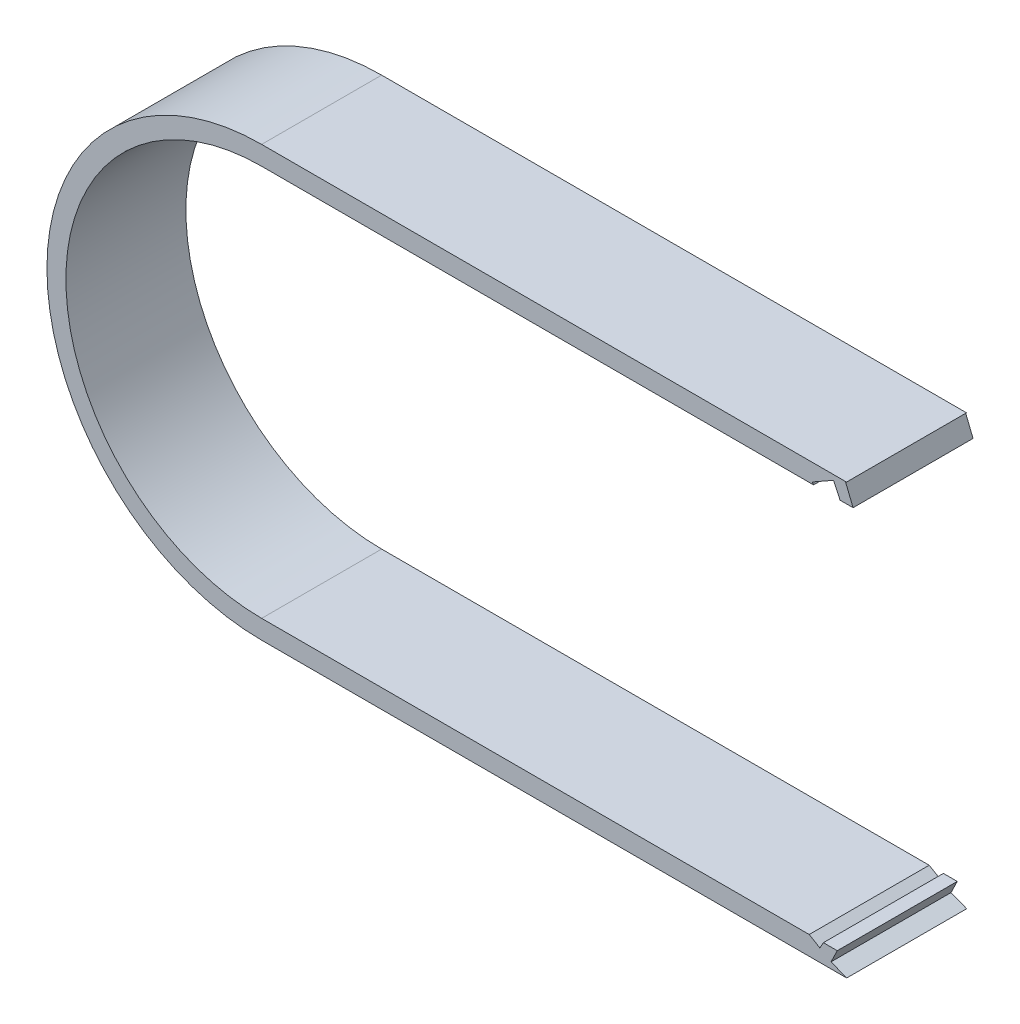
ISO-10303-21;
HEADER;
FILE_DESCRIPTION(('STEP AP214'),'2;1');
FILE_NAME('part.step','',(''),(''),'','','');
FILE_SCHEMA(('AUTOMOTIVE_DESIGN { 1 0 10303 214 1 1 1 1 }'));
ENDSEC;
DATA;
#1=APPLICATION_CONTEXT('core data for automotive mechanical design processes');
#2=APPLICATION_PROTOCOL_DEFINITION('international standard','automotive_design',2000,#1);
#3=PRODUCT_CONTEXT('',#1,'mechanical');
#4=PRODUCT('Part','Part','',(#3));
#5=PRODUCT_RELATED_PRODUCT_CATEGORY('part','',(#4));
#6=PRODUCT_DEFINITION_FORMATION('','',#4);
#7=PRODUCT_DEFINITION_CONTEXT('part definition',#1,'design');
#8=PRODUCT_DEFINITION('design','',#6,#7);
#9=PRODUCT_DEFINITION_SHAPE('','',#8);
#10=(LENGTH_UNIT() NAMED_UNIT(*) SI_UNIT(.MILLI.,.METRE.));
#11=(NAMED_UNIT(*) PLANE_ANGLE_UNIT() SI_UNIT($,.RADIAN.));
#12=(NAMED_UNIT(*) SI_UNIT($,.STERADIAN.) SOLID_ANGLE_UNIT());
#13=UNCERTAINTY_MEASURE_WITH_UNIT(LENGTH_MEASURE(1.E-05),#10,'distance_accuracy_value','');
#14=(GEOMETRIC_REPRESENTATION_CONTEXT(3) GLOBAL_UNCERTAINTY_ASSIGNED_CONTEXT((#13)) GLOBAL_UNIT_ASSIGNED_CONTEXT((#10,
#11,#12)) REPRESENTATION_CONTEXT('',''));
#15=CARTESIAN_POINT('',(0.,0.,0.));
#16=DIRECTION('',(0.,0.,1.));
#17=DIRECTION('',(1.,0.,0.));
#18=AXIS2_PLACEMENT_3D('',#15,#16,#17);
#19=CARTESIAN_POINT('',(-106.18,0.,-9.5));
#20=DIRECTION('',(0.,0.,1.));
#21=DIRECTION('',(1.,0.,0.));
#22=AXIS2_PLACEMENT_3D('',#19,#20,#21);
#23=CYLINDRICAL_SURFACE('',#22,34.);
#24=DIRECTION('',(0.,0.,1.));
#25=VECTOR('',#24,1.);
#26=CARTESIAN_POINT('',(-106.18,-34.,-9.5));
#27=LINE('',#26,#25);
#28=CARTESIAN_POINT('',(-106.18,-34.,-9.5));
#29=VERTEX_POINT('',#28);
#30=CARTESIAN_POINT('',(-106.18,-34.,9.5));
#31=VERTEX_POINT('',#30);
#32=EDGE_CURVE('E311',#29,#31,#27,.T.);
#33=ORIENTED_EDGE('',*,*,#32,.T.);
#34=CARTESIAN_POINT('',(-106.18,0.,9.5));
#35=DIRECTION('',(0.,0.,-1.));
#36=DIRECTION('',(-1.,0.,0.));
#37=AXIS2_PLACEMENT_3D('',#34,#35,#36);
#38=CIRCLE('',#37,34.);
#39=CARTESIAN_POINT('',(-106.18,34.,9.5));
#40=VERTEX_POINT('',#39);
#41=EDGE_CURVE('E284',#40,#31,#38,.F.);
#42=ORIENTED_EDGE('',*,*,#41,.F.);
#43=DIRECTION('',(0.,0.,1.));
#44=VECTOR('',#43,1.);
#45=CARTESIAN_POINT('',(-106.18,34.,-9.5));
#46=LINE('',#45,#44);
#47=CARTESIAN_POINT('',(-106.18,34.,-9.5));
#48=VERTEX_POINT('',#47);
#49=EDGE_CURVE('E310',#48,#40,#46,.T.);
#50=ORIENTED_EDGE('',*,*,#49,.F.);
#51=CARTESIAN_POINT('',(-106.18,0.,-9.5));
#52=DIRECTION('',(0.,0.,-1.));
#53=DIRECTION('',(-1.,0.,0.));
#54=AXIS2_PLACEMENT_3D('',#51,#52,#53);
#55=CIRCLE('',#54,34.);
#56=EDGE_CURVE('E304',#48,#29,#55,.F.);
#57=ORIENTED_EDGE('',*,*,#56,.T.);
#58=EDGE_LOOP('',(#33,#42,#50,#57));
#59=FACE_BOUND('',#58,.T.);
#60=ADVANCED_FACE('F81',(#59),#23,.T.);
#61=CARTESIAN_POINT('',(0.,34.0000000000001,-9.5));
#62=DIRECTION('',(0.,1.,0.));
#63=DIRECTION('',(-1.,0.,0.));
#64=AXIS2_PLACEMENT_3D('',#61,#62,#63);
#65=PLANE('',#64);
#66=DIRECTION('',(0.,0.,1.));
#67=VECTOR('',#66,1.);
#68=CARTESIAN_POINT('',(-13.5604924537327,34.0000000000001,-9.50000000000006));
#69=LINE('',#68,#67);
#70=CARTESIAN_POINT('',(-13.5604924537327,34.0000000000001,-9.5));
#71=VERTEX_POINT('',#70);
#72=CARTESIAN_POINT('',(-13.5604924537328,34.0000000000001,9.5));
#73=VERTEX_POINT('',#72);
#74=EDGE_CURVE('E265',#71,#73,#69,.T.);
#75=ORIENTED_EDGE('',*,*,#74,.F.);
#76=DIRECTION('',(-1.,0.,0.));
#77=VECTOR('',#76,1.);
#78=CARTESIAN_POINT('',(0.,34.0000000000001,-9.5));
#79=LINE('',#78,#77);
#80=EDGE_CURVE('E300',#71,#48,#79,.T.);
#81=ORIENTED_EDGE('',*,*,#80,.T.);
#82=ORIENTED_EDGE('',*,*,#49,.T.);
#83=DIRECTION('',(-1.,0.,0.));
#84=VECTOR('',#83,1.);
#85=CARTESIAN_POINT('',(0.,34.0000000000001,9.5));
#86=LINE('',#85,#84);
#87=EDGE_CURVE('E282',#73,#40,#86,.T.);
#88=ORIENTED_EDGE('',*,*,#87,.F.);
#89=EDGE_LOOP('',(#75,#81,#82,#88));
#90=FACE_BOUND('',#89,.T.);
#91=ADVANCED_FACE('F83',(#90),#65,.T.);
#92=CARTESIAN_POINT('',(-10.1045238986109,35.2816103582913,-20.5000000000001));
#93=DIRECTION('',(-0.347701294528303,0.937605359297472,0.));
#94=DIRECTION('',(-0.937605359297472,-0.347701294528303,0.));
#95=AXIS2_PLACEMENT_3D('',#92,#93,#94);
#96=PLANE('',#95);
#97=ORIENTED_EDGE('',*,*,#74,.T.);
#98=DIRECTION('',(0.937605359297472,0.347701294528303,0.));
#99=VECTOR('',#98,1.);
#100=CARTESIAN_POINT('',(-12.7236361793878,34.31033953362,9.5));
#101=LINE('',#100,#99);
#102=CARTESIAN_POINT('',(-13.7119885708228,33.9438192246815,9.49999999999995));
#103=VERTEX_POINT('',#102);
#104=EDGE_CURVE('E313',#103,#73,#101,.T.);
#105=ORIENTED_EDGE('',*,*,#104,.F.);
#106=DIRECTION('',(0.,0.,1.));
#107=VECTOR('',#106,1.);
#108=CARTESIAN_POINT('',(-13.7119885708228,33.9438192246815,-20.5000000000001));
#109=LINE('',#108,#107);
#110=CARTESIAN_POINT('',(-13.7119885708228,33.9438192246815,-9.5));
#111=VERTEX_POINT('',#110);
#112=EDGE_CURVE('E261',#111,#103,#109,.T.);
#113=ORIENTED_EDGE('',*,*,#112,.F.);
#114=DIRECTION('',(0.937605359297472,0.347701294528303,0.));
#115=VECTOR('',#114,1.);
#116=CARTESIAN_POINT('',(-12.7236361793878,34.31033953362,-9.5));
#117=LINE('',#116,#115);
#118=EDGE_CURVE('E263',#111,#71,#117,.T.);
#119=ORIENTED_EDGE('',*,*,#118,.T.);
#120=EDGE_LOOP('',(#97,#105,#113,#119));
#121=FACE_BOUND('',#120,.T.);
#122=ADVANCED_FACE('F367',(#121),#96,.F.);
#123=CARTESIAN_POINT('',(-13.7119885708228,33.9438192246815,-20.5000000000001));
#124=DIRECTION('',(-0.927204769486887,-0.374554823010956,0.));
#125=DIRECTION('',(0.374554823010956,-0.927204769486887,0.));
#126=AXIS2_PLACEMENT_3D('',#123,#124,#125);
#127=PLANE('',#126);
#128=DIRECTION('',(-0.374554823010956,0.927204769486887,0.));
#129=VECTOR('',#128,1.);
#130=CARTESIAN_POINT('',(-1.48481955402565E-13,0.,-9.5));
#131=LINE('',#130,#129);
#132=CARTESIAN_POINT('',(-12.5227995966472,31.0000000000001,-9.5));
#133=VERTEX_POINT('',#132);
#134=EDGE_CURVE('E270',#133,#111,#131,.T.);
#135=ORIENTED_EDGE('',*,*,#134,.T.);
#136=ORIENTED_EDGE('',*,*,#112,.T.);
#137=DIRECTION('',(0.374554823010956,-0.927204769486887,0.));
#138=VECTOR('',#137,1.);
#139=CARTESIAN_POINT('',(-13.7119885708228,33.9438192246815,9.49999999999995));
#140=LINE('',#139,#138);
#141=CARTESIAN_POINT('',(-12.5227995966472,31.0000000000001,9.49999999999995));
#142=VERTEX_POINT('',#141);
#143=EDGE_CURVE('E259',#103,#142,#140,.T.);
#144=ORIENTED_EDGE('',*,*,#143,.T.);
#145=DIRECTION('',(0.,0.,1.));
#146=VECTOR('',#145,1.);
#147=CARTESIAN_POINT('',(-12.5227995966472,31.0000000000001,-9.49999999999999));
#148=LINE('',#147,#146);
#149=EDGE_CURVE('E267',#133,#142,#148,.T.);
#150=ORIENTED_EDGE('',*,*,#149,.F.);
#151=EDGE_LOOP('',(#135,#136,#144,#150));
#152=FACE_BOUND('',#151,.T.);
#153=ADVANCED_FACE('F360',(#152),#127,.F.);
#154=CARTESIAN_POINT('',(0.,31.0000000000001,-9.5));
#155=DIRECTION('',(0.,1.,0.));
#156=DIRECTION('',(-1.,0.,0.));
#157=AXIS2_PLACEMENT_3D('',#154,#155,#156);
#158=PLANE('',#157);
#159=DIRECTION('',(-1.,0.,0.));
#160=VECTOR('',#159,1.);
#161=CARTESIAN_POINT('',(0.,31.0000000000001,9.5));
#162=LINE('',#161,#160);
#163=CARTESIAN_POINT('',(-14.5822358882404,31.0000000000001,9.5));
#164=VERTEX_POINT('',#163);
#165=EDGE_CURVE('E274',#142,#164,#162,.T.);
#166=ORIENTED_EDGE('',*,*,#165,.T.);
#167=DIRECTION('',(0.,0.,-1.));
#168=VECTOR('',#167,1.);
#169=CARTESIAN_POINT('',(-14.5822358882404,31.0000000000001,-9.49999999999998));
#170=LINE('',#169,#168);
#171=CARTESIAN_POINT('',(-14.5822358882404,31.0000000000001,-9.5));
#172=VERTEX_POINT('',#171);
#173=EDGE_CURVE('E246',#164,#172,#170,.T.);
#174=ORIENTED_EDGE('',*,*,#173,.T.);
#175=DIRECTION('',(-1.,0.,0.));
#176=VECTOR('',#175,1.);
#177=CARTESIAN_POINT('',(0.,31.0000000000001,-9.5));
#178=LINE('',#177,#176);
#179=EDGE_CURVE('E289',#133,#172,#178,.T.);
#180=ORIENTED_EDGE('',*,*,#179,.F.);
#181=ORIENTED_EDGE('',*,*,#149,.T.);
#182=EDGE_LOOP('',(#166,#174,#180,#181));
#183=FACE_BOUND('',#182,.T.);
#184=ADVANCED_FACE('F356',(#183),#158,.F.);
#185=CARTESIAN_POINT('',(-13.7911785586929,29.3183115810281,-20.5000000000001));
#186=DIRECTION('',(0.904886159908276,0.425653659218917,0.));
#187=DIRECTION('',(-0.425653659218917,0.904886159908276,0.));
#188=AXIS2_PLACEMENT_3D('',#185,#186,#187);
#189=PLANE('',#188);
#190=DIRECTION('',(0.425653659218917,-0.904886159908276,0.));
#191=VECTOR('',#190,1.);
#192=CARTESIAN_POINT('',(0.,0.,-9.5));
#193=LINE('',#192,#191);
#194=CARTESIAN_POINT('',(-15.621509199832,33.2093643873449,-9.5));
#195=VERTEX_POINT('',#194);
#196=EDGE_CURVE('E250',#195,#172,#193,.T.);
#197=ORIENTED_EDGE('',*,*,#196,.T.);
#198=ORIENTED_EDGE('',*,*,#173,.F.);
#199=DIRECTION('',(0.425653659218917,-0.904886159908276,0.));
#200=VECTOR('',#199,1.);
#201=CARTESIAN_POINT('',(0.,0.,9.5));
#202=LINE('',#201,#200);
#203=CARTESIAN_POINT('',(-15.621509199832,33.2093643873449,9.4999999999999));
#204=VERTEX_POINT('',#203);
#205=EDGE_CURVE('E318',#204,#164,#202,.T.);
#206=ORIENTED_EDGE('',*,*,#205,.F.);
#207=DIRECTION('',(0.,0.,1.));
#208=VECTOR('',#207,1.);
#209=CARTESIAN_POINT('',(-15.621509199832,33.2093643873448,-20.5000000000001));
#210=LINE('',#209,#208);
#211=EDGE_CURVE('E243',#195,#204,#210,.T.);
#212=ORIENTED_EDGE('',*,*,#211,.F.);
#213=EDGE_LOOP('',(#197,#198,#206,#212));
#214=FACE_BOUND('',#213,.T.);
#215=ADVANCED_FACE('F351',(#214),#189,.F.);
#216=CARTESIAN_POINT('',(-15.621509199832,33.2093643873448,-20.5000000000001));
#217=DIRECTION('',(-0.493293834195668,0.869862743853613,0.));
#218=DIRECTION('',(-0.869862743853613,-0.493293834195668,0.));
#219=AXIS2_PLACEMENT_3D('',#216,#217,#218);
#220=PLANE('',#219);
#221=DIRECTION('',(0.869862743853613,0.493293834195668,0.));
#222=VECTOR('',#221,1.);
#223=CARTESIAN_POINT('',(-18.0513888634085,31.8313945129603,-9.5));
#224=LINE('',#223,#222);
#225=CARTESIAN_POINT('',(-18.9683321323251,31.3114016013661,-9.5));
#226=VERTEX_POINT('',#225);
#227=EDGE_CURVE('E252',#226,#195,#224,.T.);
#228=ORIENTED_EDGE('',*,*,#227,.T.);
#229=ORIENTED_EDGE('',*,*,#211,.T.);
#230=DIRECTION('',(-0.869862743853613,-0.493293834195668,0.));
#231=VECTOR('',#230,1.);
#232=CARTESIAN_POINT('',(-15.621509199832,33.2093643873449,9.4999999999999));
#233=LINE('',#232,#231);
#234=CARTESIAN_POINT('',(-18.9683321323251,31.3114016013662,9.4999999999999));
#235=VERTEX_POINT('',#234);
#236=EDGE_CURVE('E238',#204,#235,#233,.T.);
#237=ORIENTED_EDGE('',*,*,#236,.T.);
#238=DIRECTION('',(0.,0.,1.));
#239=VECTOR('',#238,1.);
#240=CARTESIAN_POINT('',(-18.9683321323251,31.3114016013661,-20.5000000000001));
#241=LINE('',#240,#239);
#242=EDGE_CURVE('E244',#226,#235,#241,.T.);
#243=ORIENTED_EDGE('',*,*,#242,.F.);
#244=EDGE_LOOP('',(#228,#229,#237,#243));
#245=FACE_BOUND('',#244,.T.);
#246=ADVANCED_FACE('F348',(#245),#220,.F.);
#247=CARTESIAN_POINT('',(-18.9683321323251,31.3114016013661,-20.5000000000001));
#248=DIRECTION('',(-0.855298006153534,-0.518136391956587,0.));
#249=DIRECTION('',(0.518136391956587,-0.855298006153534,0.));
#250=AXIS2_PLACEMENT_3D('',#247,#248,#249);
#251=PLANE('',#250);
#252=DIRECTION('',(-0.518136391956587,0.855298006153534,0.));
#253=VECTOR('',#252,1.);
#254=CARTESIAN_POINT('',(-1.55309446926976E-13,0.,-9.5));
#255=LINE('',#254,#253);
#256=CARTESIAN_POINT('',(-18.7796861855084,31.0000000000001,-9.5));
#257=VERTEX_POINT('',#256);
#258=EDGE_CURVE('E257',#257,#226,#255,.T.);
#259=ORIENTED_EDGE('',*,*,#258,.T.);
#260=ORIENTED_EDGE('',*,*,#242,.T.);
#261=DIRECTION('',(0.518136391956587,-0.855298006153534,0.));
#262=VECTOR('',#261,1.);
#263=CARTESIAN_POINT('',(-18.9683321323251,31.3114016013662,9.4999999999999));
#264=LINE('',#263,#262);
#265=CARTESIAN_POINT('',(-18.7796861855083,31.0000000000001,9.4999999999999));
#266=VERTEX_POINT('',#265);
#267=EDGE_CURVE('E241',#235,#266,#264,.T.);
#268=ORIENTED_EDGE('',*,*,#267,.T.);
#269=DIRECTION('',(0.,0.,1.));
#270=VECTOR('',#269,1.);
#271=CARTESIAN_POINT('',(-18.7796861855084,31.0000000000001,-9.49999999999997));
#272=LINE('',#271,#270);
#273=EDGE_CURVE('E254',#257,#266,#272,.T.);
#274=ORIENTED_EDGE('',*,*,#273,.F.);
#275=EDGE_LOOP('',(#259,#260,#268,#274));
#276=FACE_BOUND('',#275,.T.);
#277=ADVANCED_FACE('F339',(#276),#251,.F.);
#278=CARTESIAN_POINT('',(-106.18,31.,-9.5));
#279=VERTEX_POINT('',#278);
#280=EDGE_CURVE('E287',#257,#279,#178,.T.);
#281=ORIENTED_EDGE('',*,*,#280,.F.);
#282=ORIENTED_EDGE('',*,*,#273,.T.);
#283=CARTESIAN_POINT('',(-106.18,31.,9.5));
#284=VERTEX_POINT('',#283);
#285=EDGE_CURVE('E272',#266,#284,#162,.T.);
#286=ORIENTED_EDGE('',*,*,#285,.T.);
#287=DIRECTION('',(0.,0.,1.));
#288=VECTOR('',#287,1.);
#289=CARTESIAN_POINT('',(-106.18,31.,-9.5));
#290=LINE('',#289,#288);
#291=EDGE_CURVE('E297',#279,#284,#290,.T.);
#292=ORIENTED_EDGE('',*,*,#291,.F.);
#293=EDGE_LOOP('',(#281,#282,#286,#292));
#294=FACE_BOUND('',#293,.T.);
#295=ADVANCED_FACE('F336',(#294),#158,.F.);
#296=CARTESIAN_POINT('',(-106.18,0.,-9.5));
#297=DIRECTION('',(0.,0.,1.));
#298=DIRECTION('',(1.,0.,0.));
#299=AXIS2_PLACEMENT_3D('',#296,#297,#298);
#300=CYLINDRICAL_SURFACE('',#299,31.);
#301=ORIENTED_EDGE('',*,*,#291,.T.);
#302=CARTESIAN_POINT('',(-106.18,0.,9.5));
#303=DIRECTION('',(0.,0.,-1.));
#304=DIRECTION('',(-1.,0.,0.));
#305=AXIS2_PLACEMENT_3D('',#302,#303,#304);
#306=CIRCLE('',#305,31.);
#307=CARTESIAN_POINT('',(-106.18,-31.,9.5));
#308=VERTEX_POINT('',#307);
#309=EDGE_CURVE('E275',#284,#308,#306,.F.);
#310=ORIENTED_EDGE('',*,*,#309,.T.);
#311=DIRECTION('',(0.,0.,1.));
#312=VECTOR('',#311,1.);
#313=CARTESIAN_POINT('',(-106.18,-31.,-9.5));
#314=LINE('',#313,#312);
#315=CARTESIAN_POINT('',(-106.18,-31.,-9.5));
#316=VERTEX_POINT('',#315);
#317=EDGE_CURVE('E298',#316,#308,#314,.T.);
#318=ORIENTED_EDGE('',*,*,#317,.F.);
#319=CARTESIAN_POINT('',(-106.18,0.,-9.5));
#320=DIRECTION('',(0.,0.,-1.));
#321=DIRECTION('',(-1.,0.,0.));
#322=AXIS2_PLACEMENT_3D('',#319,#320,#321);
#323=CIRCLE('',#322,31.);
#324=EDGE_CURVE('E290',#279,#316,#323,.F.);
#325=ORIENTED_EDGE('',*,*,#324,.F.);
#326=EDGE_LOOP('',(#301,#310,#318,#325));
#327=FACE_BOUND('',#326,.T.);
#328=ADVANCED_FACE('F329',(#327),#300,.F.);
#329=CARTESIAN_POINT('',(0.,-30.9999999999999,-9.5));
#330=DIRECTION('',(0.,-1.,0.));
#331=DIRECTION('',(1.,0.,0.));
#332=AXIS2_PLACEMENT_3D('',#329,#330,#331);
#333=PLANE('',#332);
#334=DIRECTION('',(1.,0.,0.));
#335=VECTOR('',#334,1.);
#336=CARTESIAN_POINT('',(0.,-30.9999999999999,9.5));
#337=LINE('',#336,#335);
#338=CARTESIAN_POINT('',(-19.465689183762,-30.9999999999999,9.5));
#339=VERTEX_POINT('',#338);
#340=EDGE_CURVE('E279',#308,#339,#337,.T.);
#341=ORIENTED_EDGE('',*,*,#340,.T.);
#342=DIRECTION('',(0.,0.,-1.));
#343=VECTOR('',#342,1.);
#344=CARTESIAN_POINT('',(-19.465689183762,-30.9999999999999,-9.50000000000006));
#345=LINE('',#344,#343);
#346=CARTESIAN_POINT('',(-19.465689183762,-30.9999999999999,-9.5));
#347=VERTEX_POINT('',#346);
#348=EDGE_CURVE('E103',#339,#347,#345,.T.);
#349=ORIENTED_EDGE('',*,*,#348,.T.);
#350=DIRECTION('',(1.,0.,0.));
#351=VECTOR('',#350,1.);
#352=CARTESIAN_POINT('',(0.,-30.9999999999999,-9.5));
#353=LINE('',#352,#351);
#354=EDGE_CURVE('E294',#316,#347,#353,.T.);
#355=ORIENTED_EDGE('',*,*,#354,.F.);
#356=ORIENTED_EDGE('',*,*,#317,.T.);
#357=EDGE_LOOP('',(#341,#349,#355,#356));
#358=FACE_BOUND('',#357,.T.);
#359=ADVANCED_FACE('F325',(#358),#333,.F.);
#360=CARTESIAN_POINT('',(-21.0875785711729,-30.0367685128825,-20.5000000000001));
#361=DIRECTION('',(-0.510630726639647,-0.859800128524919,0.));
#362=DIRECTION('',(0.859800128524919,-0.510630726639647,0.));
#363=AXIS2_PLACEMENT_3D('',#360,#361,#362);
#364=PLANE('',#363);
#365=DIRECTION('',(-0.859800128524919,0.510630726639647,0.));
#366=VECTOR('',#365,1.);
#367=CARTESIAN_POINT('',(-18.6858078759625,-31.4631673637656,-9.5));
#368=LINE('',#367,#366);
#369=CARTESIAN_POINT('',(-17.7794718522216,-32.0014355112437,-9.5));
#370=VERTEX_POINT('',#369);
#371=EDGE_CURVE('E231',#370,#347,#368,.T.);
#372=ORIENTED_EDGE('',*,*,#371,.T.);
#373=ORIENTED_EDGE('',*,*,#348,.F.);
#374=DIRECTION('',(-0.859800128524919,0.510630726639647,0.));
#375=VECTOR('',#374,1.);
#376=CARTESIAN_POINT('',(-18.6858078759625,-31.4631673637657,9.5));
#377=LINE('',#376,#375);
#378=CARTESIAN_POINT('',(-17.7794718522219,-32.0014355112436,9.49999999999996));
#379=VERTEX_POINT('',#378);
#380=EDGE_CURVE('E89',#379,#339,#377,.T.);
#381=ORIENTED_EDGE('',*,*,#380,.F.);
#382=DIRECTION('',(0.,0.,1.));
#383=VECTOR('',#382,1.);
#384=CARTESIAN_POINT('',(-17.7794718522214,-32.0014355112438,-20.5));
#385=LINE('',#384,#383);
#386=EDGE_CURVE('E228',#370,#379,#385,.T.);
#387=ORIENTED_EDGE('',*,*,#386,.F.);
#388=EDGE_LOOP('',(#372,#373,#381,#387));
#389=FACE_BOUND('',#388,.T.);
#390=ADVANCED_FACE('F385',(#389),#364,.F.);
#391=CARTESIAN_POINT('',(-17.7794718522214,-32.0014355112438,-20.5));
#392=DIRECTION('',(0.874146878995773,-0.485661645533132,0.));
#393=DIRECTION('',(0.485661645533132,0.874146878995773,0.));
#394=AXIS2_PLACEMENT_3D('',#391,#392,#393);
#395=PLANE('',#394);
#396=DIRECTION('',(-0.485661645533132,-0.874146878995773,0.));
#397=VECTOR('',#396,1.);
#398=CARTESIAN_POINT('',(2.82694100573245E-13,0.,-9.5));
#399=LINE('',#398,#397);
#400=CARTESIAN_POINT('',(-17.2230907337022,-30.9999999999999,-9.5));
#401=VERTEX_POINT('',#400);
#402=EDGE_CURVE('E236',#401,#370,#399,.T.);
#403=ORIENTED_EDGE('',*,*,#402,.T.);
#404=ORIENTED_EDGE('',*,*,#386,.T.);
#405=DIRECTION('',(0.485661645533132,0.874146878995773,0.));
#406=VECTOR('',#405,1.);
#407=CARTESIAN_POINT('',(-17.7794718522219,-32.0014355112436,9.49999999999996));
#408=LINE('',#407,#406);
#409=CARTESIAN_POINT('',(-17.2230907337025,-30.9999999999999,9.49999999999996));
#410=VERTEX_POINT('',#409);
#411=EDGE_CURVE('E226',#379,#410,#408,.T.);
#412=ORIENTED_EDGE('',*,*,#411,.T.);
#413=DIRECTION('',(0.,0.,1.));
#414=VECTOR('',#413,1.);
#415=CARTESIAN_POINT('',(-17.2230907337022,-30.9999999999999,-9.50000000000035));
#416=LINE('',#415,#414);
#417=EDGE_CURVE('E233',#401,#410,#416,.T.);
#418=ORIENTED_EDGE('',*,*,#417,.F.);
#419=EDGE_LOOP('',(#403,#404,#412,#418));
#420=FACE_BOUND('',#419,.T.);
#421=ADVANCED_FACE('F383',(#420),#395,.F.);
#422=CARTESIAN_POINT('',(0.,0.,-9.5));
#423=DIRECTION('',(0.,0.,-1.));
#424=DIRECTION('',(-1.,0.,0.));
#425=AXIS2_PLACEMENT_3D('',#422,#423,#424);
#426=PLANE('',#425);
#427=DIRECTION('',(-0.930447469573626,0.366425308028849,0.));
#428=VECTOR('',#427,1.);
#429=CARTESIAN_POINT('',(-13.4088149214518,-34.048406701929,-9.5));
#430=LINE('',#429,#428);
#431=CARTESIAN_POINT('',(-13.5317319043494,-34.,-9.5));
#432=VERTEX_POINT('',#431);
#433=CARTESIAN_POINT('',(-16.0079323113139,-33.0248321087069,-9.5));
#434=VERTEX_POINT('',#433);
#435=EDGE_CURVE('E206',#432,#434,#430,.T.);
#436=ORIENTED_EDGE('',*,*,#435,.F.);
#437=DIRECTION('',(1.,0.,0.));
#438=VECTOR('',#437,1.);
#439=CARTESIAN_POINT('',(0.,-33.9999999999999,-9.5));
#440=LINE('',#439,#438);
#441=EDGE_CURVE('E307',#29,#432,#440,.T.);
#442=ORIENTED_EDGE('',*,*,#441,.F.);
#443=ORIENTED_EDGE('',*,*,#56,.F.);
#444=ORIENTED_EDGE('',*,*,#80,.F.);
#445=ORIENTED_EDGE('',*,*,#118,.F.);
#446=ORIENTED_EDGE('',*,*,#134,.F.);
#447=ORIENTED_EDGE('',*,*,#179,.T.);
#448=ORIENTED_EDGE('',*,*,#196,.F.);
#449=ORIENTED_EDGE('',*,*,#227,.F.);
#450=ORIENTED_EDGE('',*,*,#258,.F.);
#451=ORIENTED_EDGE('',*,*,#280,.T.);
#452=ORIENTED_EDGE('',*,*,#324,.T.);
#453=ORIENTED_EDGE('',*,*,#354,.T.);
#454=ORIENTED_EDGE('',*,*,#371,.F.);
#455=ORIENTED_EDGE('',*,*,#402,.F.);
#456=CARTESIAN_POINT('',(-15.0264473720033,-30.9999999999999,-9.5));
#457=VERTEX_POINT('',#456);
#458=EDGE_CURVE('E293',#401,#457,#353,.T.);
#459=ORIENTED_EDGE('',*,*,#458,.T.);
#460=DIRECTION('',(0.436182885896382,0.899858038832295,0.));
#461=VECTOR('',#460,1.);
#462=CARTESIAN_POINT('',(2.27211835847417E-13,0.,-9.5));
#463=LINE('',#462,#461);
#464=EDGE_CURVE('E208',#434,#457,#463,.T.);
#465=ORIENTED_EDGE('',*,*,#464,.F.);
#466=EDGE_LOOP('',(#436,#442,#443,#444,#445,#446,#447,#448,#449,#450,#451,#452,#453,#454,#455,
#459,#465));
#467=FACE_BOUND('',#466,.T.);
#468=ADVANCED_FACE('F343',(#467),#426,.T.);
#469=CARTESIAN_POINT('',(0.,0.,9.5));
#470=DIRECTION('',(0.,0.,-1.));
#471=DIRECTION('',(-1.,0.,0.));
#472=AXIS2_PLACEMENT_3D('',#469,#470,#471);
#473=PLANE('',#472);
#474=DIRECTION('',(1.,0.,0.));
#475=VECTOR('',#474,1.);
#476=CARTESIAN_POINT('',(0.,-33.9999999999999,9.5));
#477=LINE('',#476,#475);
#478=CARTESIAN_POINT('',(-13.5317319043494,-34.,9.49999999999999));
#479=VERTEX_POINT('',#478);
#480=EDGE_CURVE('E218',#31,#479,#477,.T.);
#481=ORIENTED_EDGE('',*,*,#480,.T.);
#482=DIRECTION('',(0.930447469573626,-0.366425308028849,0.));
#483=VECTOR('',#482,1.);
#484=CARTESIAN_POINT('',(-16.0079323113142,-33.0248321087068,9.49999999999994));
#485=LINE('',#484,#483);
#486=CARTESIAN_POINT('',(-16.0079323113142,-33.0248321087068,9.49999999999994));
#487=VERTEX_POINT('',#486);
#488=EDGE_CURVE('E203',#487,#479,#485,.T.);
#489=ORIENTED_EDGE('',*,*,#488,.F.);
#490=DIRECTION('',(0.436182885896382,0.899858038832295,0.));
#491=VECTOR('',#490,1.);
#492=CARTESIAN_POINT('',(0.,1.31507902301936E-13,9.5));
#493=LINE('',#492,#491);
#494=CARTESIAN_POINT('',(-15.0264473720037,-30.9999999999999,9.5));
#495=VERTEX_POINT('',#494);
#496=EDGE_CURVE('E12',#487,#495,#493,.T.);
#497=ORIENTED_EDGE('',*,*,#496,.T.);
#498=EDGE_CURVE('E278',#410,#495,#337,.T.);
#499=ORIENTED_EDGE('',*,*,#498,.F.);
#500=ORIENTED_EDGE('',*,*,#411,.F.);
#501=ORIENTED_EDGE('',*,*,#380,.T.);
#502=ORIENTED_EDGE('',*,*,#340,.F.);
#503=ORIENTED_EDGE('',*,*,#309,.F.);
#504=ORIENTED_EDGE('',*,*,#285,.F.);
#505=ORIENTED_EDGE('',*,*,#267,.F.);
#506=ORIENTED_EDGE('',*,*,#236,.F.);
#507=ORIENTED_EDGE('',*,*,#205,.T.);
#508=ORIENTED_EDGE('',*,*,#165,.F.);
#509=ORIENTED_EDGE('',*,*,#143,.F.);
#510=ORIENTED_EDGE('',*,*,#104,.T.);
#511=ORIENTED_EDGE('',*,*,#87,.T.);
#512=ORIENTED_EDGE('',*,*,#41,.T.);
#513=EDGE_LOOP('',(#481,#489,#497,#499,#500,#501,#502,#503,#504,#505,#506,#507,#508,#509,#510,
#511,#512));
#514=FACE_BOUND('',#513,.T.);
#515=ADVANCED_FACE('F215',(#514),#473,.F.);
#516=CARTESIAN_POINT('',(0.,-33.9999999999999,-9.5));
#517=DIRECTION('',(0.,-1.,0.));
#518=DIRECTION('',(1.,0.,0.));
#519=AXIS2_PLACEMENT_3D('',#516,#517,#518);
#520=PLANE('',#519);
#521=DIRECTION('',(0.,0.,-1.));
#522=VECTOR('',#521,1.);
#523=CARTESIAN_POINT('',(-13.5317319043496,-33.9999999999999,-9.50000000000001));
#524=LINE('',#523,#522);
#525=EDGE_CURVE('E224',#479,#432,#524,.T.);
#526=ORIENTED_EDGE('',*,*,#525,.F.);
#527=ORIENTED_EDGE('',*,*,#480,.F.);
#528=ORIENTED_EDGE('',*,*,#32,.F.);
#529=ORIENTED_EDGE('',*,*,#441,.T.);
#530=EDGE_LOOP('',(#526,#527,#528,#529));
#531=FACE_BOUND('',#530,.T.);
#532=ADVANCED_FACE('F375',(#531),#520,.T.);
#533=ORIENTED_EDGE('',*,*,#498,.T.);
#534=DIRECTION('',(0.,0.,-1.));
#535=VECTOR('',#534,1.);
#536=CARTESIAN_POINT('',(-15.0264473720033,-30.9999999999999,-9.5000000000003));
#537=LINE('',#536,#535);
#538=EDGE_CURVE('E96',#495,#457,#537,.T.);
#539=ORIENTED_EDGE('',*,*,#538,.T.);
#540=ORIENTED_EDGE('',*,*,#458,.F.);
#541=ORIENTED_EDGE('',*,*,#417,.T.);
#542=EDGE_LOOP('',(#533,#539,#540,#541));
#543=FACE_BOUND('',#542,.T.);
#544=ADVANCED_FACE('F381',(#543),#333,.F.);
#545=CARTESIAN_POINT('',(-14.1323255030424,-29.1554004581665,-20.5000000000001));
#546=DIRECTION('',(-0.899858038832295,0.436182885896382,0.));
#547=DIRECTION('',(-0.436182885896382,-0.899858038832295,0.));
#548=AXIS2_PLACEMENT_3D('',#545,#546,#547);
#549=PLANE('',#548);
#550=ORIENTED_EDGE('',*,*,#496,.F.);
#551=DIRECTION('',(0.,0.,1.));
#552=VECTOR('',#551,1.);
#553=CARTESIAN_POINT('',(-16.0079323113137,-33.024832108707,-20.5000000000001));
#554=LINE('',#553,#552);
#555=EDGE_CURVE('E200',#434,#487,#554,.T.);
#556=ORIENTED_EDGE('',*,*,#555,.F.);
#557=ORIENTED_EDGE('',*,*,#464,.T.);
#558=ORIENTED_EDGE('',*,*,#538,.F.);
#559=EDGE_LOOP('',(#550,#556,#557,#558));
#560=FACE_BOUND('',#559,.T.);
#561=ADVANCED_FACE('F210',(#560),#549,.F.);
#562=CARTESIAN_POINT('',(-16.0079323113137,-33.024832108707,-20.5000000000001));
#563=DIRECTION('',(-0.366425308028849,-0.930447469573626,0.));
#564=DIRECTION('',(0.930447469573626,-0.366425308028849,0.));
#565=AXIS2_PLACEMENT_3D('',#562,#563,#564);
#566=PLANE('',#565);
#567=ORIENTED_EDGE('',*,*,#525,.T.);
#568=ORIENTED_EDGE('',*,*,#435,.T.);
#569=ORIENTED_EDGE('',*,*,#555,.T.);
#570=ORIENTED_EDGE('',*,*,#488,.T.);
#571=EDGE_LOOP('',(#567,#568,#569,#570));
#572=FACE_BOUND('',#571,.T.);
#573=ADVANCED_FACE('F201',(#572),#566,.F.);
#574=CLOSED_SHELL('',(#60,#91,#122,#153,#184,#215,#246,#277,#295,#328,#359,#390,#421,#468,#515,
#532,#544,#561,#573));
#575=MANIFOLD_SOLID_BREP('B2',#574);
#576=ADVANCED_BREP_SHAPE_REPRESENTATION('',(#18,#575),#14);
#577=SHAPE_DEFINITION_REPRESENTATION(#9,#576);
ENDSEC;
END-ISO-10303-21;
